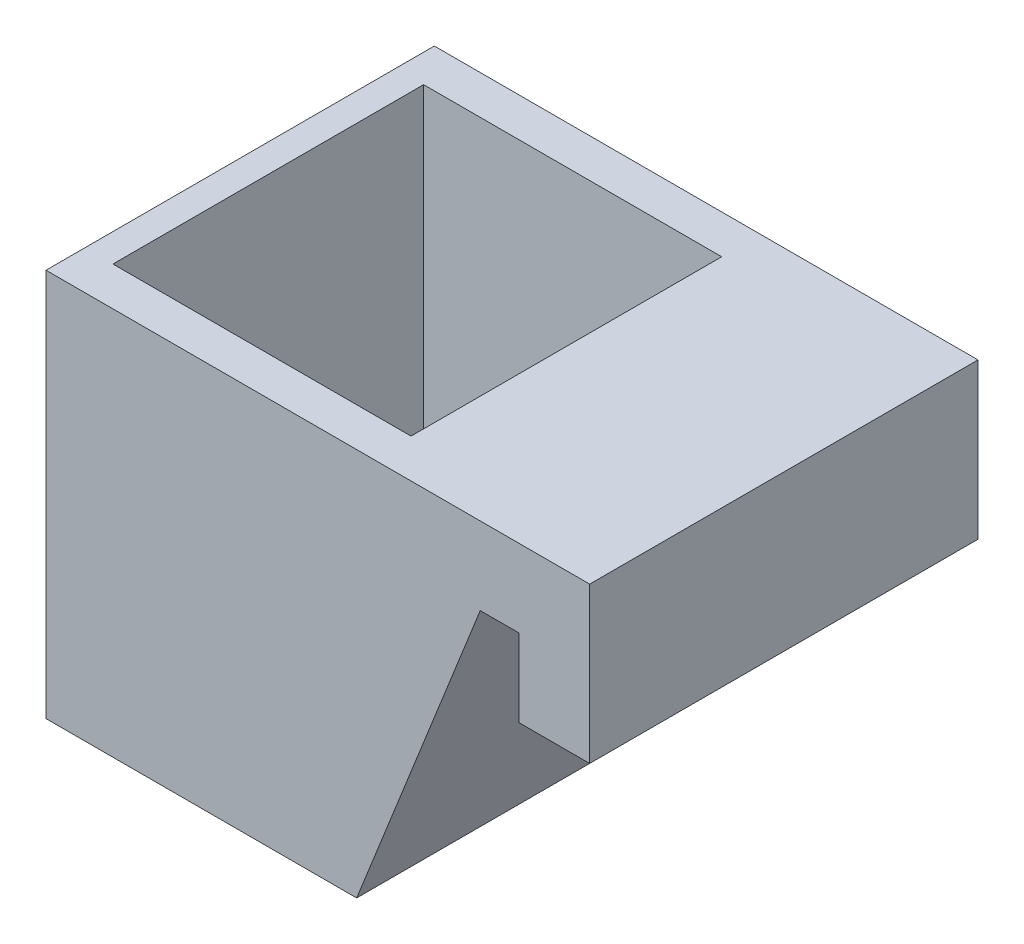
ISO-10303-21;
HEADER;
FILE_DESCRIPTION(('STEP AP214'),'2;1');
FILE_NAME('part.step','',(''),(''),'','','');
FILE_SCHEMA(('AUTOMOTIVE_DESIGN { 1 0 10303 214 1 1 1 1 }'));
ENDSEC;
DATA;
#1=APPLICATION_CONTEXT('core data for automotive mechanical design processes');
#2=APPLICATION_PROTOCOL_DEFINITION('international standard','automotive_design',2000,#1);
#3=PRODUCT_CONTEXT('',#1,'mechanical');
#4=PRODUCT('Part','Part','',(#3));
#5=PRODUCT_RELATED_PRODUCT_CATEGORY('part','',(#4));
#6=PRODUCT_DEFINITION_FORMATION('','',#4);
#7=PRODUCT_DEFINITION_CONTEXT('part definition',#1,'design');
#8=PRODUCT_DEFINITION('design','',#6,#7);
#9=PRODUCT_DEFINITION_SHAPE('','',#8);
#10=(LENGTH_UNIT() NAMED_UNIT(*) SI_UNIT(.MILLI.,.METRE.));
#11=(NAMED_UNIT(*) PLANE_ANGLE_UNIT() SI_UNIT($,.RADIAN.));
#12=(NAMED_UNIT(*) SI_UNIT($,.STERADIAN.) SOLID_ANGLE_UNIT());
#13=UNCERTAINTY_MEASURE_WITH_UNIT(LENGTH_MEASURE(1.E-05),#10,'distance_accuracy_value','');
#14=(GEOMETRIC_REPRESENTATION_CONTEXT(3) GLOBAL_UNCERTAINTY_ASSIGNED_CONTEXT((#13)) GLOBAL_UNIT_ASSIGNED_CONTEXT((#10,
#11,#12)) REPRESENTATION_CONTEXT('',''));
#15=CARTESIAN_POINT('',(0.,0.,0.));
#16=DIRECTION('',(0.,0.,1.));
#17=DIRECTION('',(1.,0.,0.));
#18=AXIS2_PLACEMENT_3D('',#15,#16,#17);
#19=CARTESIAN_POINT('',(14.0909090909091,31.8181818181818,50.));
#20=DIRECTION('',(0.,-1.,0.));
#21=DIRECTION('',(0.,0.,-1.));
#22=AXIS2_PLACEMENT_3D('',#19,#20,#21);
#23=PLANE('',#22);
#24=DIRECTION('',(-1.,0.,0.));
#25=VECTOR('',#24,1.);
#26=CARTESIAN_POINT('',(-13.9090909090909,31.8181818181818,5.));
#27=LINE('',#26,#25);
#28=CARTESIAN_POINT('',(-13.9090909090909,31.8181818181818,4.99999999999999));
#29=VERTEX_POINT('',#28);
#30=CARTESIAN_POINT('',(-52.2909865349845,31.8181818181818,5.00000000000001));
#31=VERTEX_POINT('',#30);
#32=EDGE_CURVE('E221',#29,#31,#27,.T.);
#33=ORIENTED_EDGE('',*,*,#32,.F.);
#34=DIRECTION('',(0.,0.,-1.));
#35=VECTOR('',#34,1.);
#36=CARTESIAN_POINT('',(-13.9090909090909,31.8181818181818,5.));
#37=LINE('',#36,#35);
#38=CARTESIAN_POINT('',(-13.9090909090909,31.8181818181818,45.));
#39=VERTEX_POINT('',#38);
#40=EDGE_CURVE('E195',#39,#29,#37,.T.);
#41=ORIENTED_EDGE('',*,*,#40,.F.);
#42=DIRECTION('',(1.,0.,0.));
#43=VECTOR('',#42,1.);
#44=CARTESIAN_POINT('',(-13.9090909090909,31.8181818181818,45.));
#45=LINE('',#44,#43);
#46=CARTESIAN_POINT('',(-52.2909865349845,31.8181818181818,45.));
#47=VERTEX_POINT('',#46);
#48=EDGE_CURVE('E206',#47,#39,#45,.T.);
#49=ORIENTED_EDGE('',*,*,#48,.F.);
#50=DIRECTION('',(0.,0.,1.));
#51=VECTOR('',#50,1.);
#52=CARTESIAN_POINT('',(-52.2909865349845,31.8181818181818,5.00000000000001));
#53=LINE('',#52,#51);
#54=EDGE_CURVE('E225',#31,#47,#53,.T.);
#55=ORIENTED_EDGE('',*,*,#54,.F.);
#56=EDGE_LOOP('',(#33,#41,#49,#55));
#57=FACE_BOUND('',#56,.T.);
#58=DIRECTION('',(-1.,0.,0.));
#59=VECTOR('',#58,1.);
#60=CARTESIAN_POINT('',(14.0909090909091,31.8181818181818,0.));
#61=LINE('',#60,#59);
#62=CARTESIAN_POINT('',(14.0909090909091,31.8181818181818,0.));
#63=VERTEX_POINT('',#62);
#64=CARTESIAN_POINT('',(-55.9090909090909,31.8181818181818,0.));
#65=VERTEX_POINT('',#64);
#66=EDGE_CURVE('E235',#63,#65,#61,.T.);
#67=ORIENTED_EDGE('',*,*,#66,.T.);
#68=DIRECTION('',(0.,0.,-1.));
#69=VECTOR('',#68,1.);
#70=CARTESIAN_POINT('',(-55.9090909090909,31.8181818181818,50.));
#71=LINE('',#70,#69);
#72=CARTESIAN_POINT('',(-55.9090909090909,31.8181818181818,50.));
#73=VERTEX_POINT('',#72);
#74=EDGE_CURVE('E11',#73,#65,#71,.T.);
#75=ORIENTED_EDGE('',*,*,#74,.F.);
#76=DIRECTION('',(-1.,0.,0.));
#77=VECTOR('',#76,1.);
#78=CARTESIAN_POINT('',(14.0909090909091,31.8181818181818,50.));
#79=LINE('',#78,#77);
#80=CARTESIAN_POINT('',(14.0909090909091,31.8181818181818,50.));
#81=VERTEX_POINT('',#80);
#82=EDGE_CURVE('E245',#81,#73,#79,.T.);
#83=ORIENTED_EDGE('',*,*,#82,.F.);
#84=DIRECTION('',(0.,0.,-1.));
#85=VECTOR('',#84,1.);
#86=CARTESIAN_POINT('',(14.0909090909091,31.8181818181818,50.));
#87=LINE('',#86,#85);
#88=EDGE_CURVE('E271',#81,#63,#87,.T.);
#89=ORIENTED_EDGE('',*,*,#88,.T.);
#90=EDGE_LOOP('',(#67,#75,#83,#89));
#91=FACE_BOUND('',#90,.T.);
#92=ADVANCED_FACE('F39',(#57,#91),#23,.F.);
#93=CARTESIAN_POINT('',(-55.9090909090909,31.8181818181818,50.));
#94=DIRECTION('',(1.,0.,0.));
#95=DIRECTION('',(0.,0.,-1.));
#96=AXIS2_PLACEMENT_3D('',#93,#94,#95);
#97=PLANE('',#96);
#98=DIRECTION('',(0.,-1.,0.));
#99=VECTOR('',#98,1.);
#100=CARTESIAN_POINT('',(-55.9090909090909,31.8181818181818,0.));
#101=LINE('',#100,#99);
#102=CARTESIAN_POINT('',(-55.9090909090909,-18.1818181818182,0.));
#103=VERTEX_POINT('',#102);
#104=EDGE_CURVE('E275',#65,#103,#101,.T.);
#105=ORIENTED_EDGE('',*,*,#104,.T.);
#106=DIRECTION('',(0.,0.,-1.));
#107=VECTOR('',#106,1.);
#108=CARTESIAN_POINT('',(-55.9090909090909,-18.1818181818182,50.));
#109=LINE('',#108,#107);
#110=CARTESIAN_POINT('',(-55.9090909090909,-18.1818181818182,50.));
#111=VERTEX_POINT('',#110);
#112=EDGE_CURVE('E47',#111,#103,#109,.T.);
#113=ORIENTED_EDGE('',*,*,#112,.F.);
#114=DIRECTION('',(0.,-1.,0.));
#115=VECTOR('',#114,1.);
#116=CARTESIAN_POINT('',(-55.9090909090909,31.8181818181818,50.));
#117=LINE('',#116,#115);
#118=EDGE_CURVE('E249',#73,#111,#117,.T.);
#119=ORIENTED_EDGE('',*,*,#118,.F.);
#120=ORIENTED_EDGE('',*,*,#74,.T.);
#121=EDGE_LOOP('',(#105,#113,#119,#120));
#122=FACE_BOUND('',#121,.T.);
#123=ADVANCED_FACE('F344',(#122),#97,.F.);
#124=CARTESIAN_POINT('',(-55.9090909090909,-18.1818181818182,50.));
#125=DIRECTION('',(0.,1.,0.));
#126=DIRECTION('',(0.,0.,1.));
#127=AXIS2_PLACEMENT_3D('',#124,#125,#126);
#128=PLANE('',#127);
#129=DIRECTION('',(1.,0.,0.));
#130=VECTOR('',#129,1.);
#131=CARTESIAN_POINT('',(-55.9090909090909,-18.1818181818182,0.));
#132=LINE('',#131,#130);
#133=CARTESIAN_POINT('',(-15.9090909090909,-18.1818181818182,0.));
#134=VERTEX_POINT('',#133);
#135=EDGE_CURVE('E278',#103,#134,#132,.T.);
#136=ORIENTED_EDGE('',*,*,#135,.T.);
#137=DIRECTION('',(0.,0.,-1.));
#138=VECTOR('',#137,1.);
#139=CARTESIAN_POINT('',(-15.9090909090909,-18.1818181818182,50.));
#140=LINE('',#139,#138);
#141=CARTESIAN_POINT('',(-15.9090909090909,-18.1818181818182,50.));
#142=VERTEX_POINT('',#141);
#143=EDGE_CURVE('E314',#142,#134,#140,.T.);
#144=ORIENTED_EDGE('',*,*,#143,.F.);
#145=DIRECTION('',(1.,0.,0.));
#146=VECTOR('',#145,1.);
#147=CARTESIAN_POINT('',(-55.9090909090909,-18.1818181818182,50.));
#148=LINE('',#147,#146);
#149=EDGE_CURVE('E253',#111,#142,#148,.T.);
#150=ORIENTED_EDGE('',*,*,#149,.F.);
#151=ORIENTED_EDGE('',*,*,#112,.T.);
#152=EDGE_LOOP('',(#136,#144,#150,#151));
#153=FACE_BOUND('',#152,.T.);
#154=ADVANCED_FACE('F323',(#153),#128,.F.);
#155=CARTESIAN_POINT('',(-15.9090909090909,-18.1818181818182,50.));
#156=DIRECTION('',(-0.929203121657371,0.369569423386455,0.));
#157=DIRECTION('',(-0.369569423386455,-0.929203121657371,0.));
#158=AXIS2_PLACEMENT_3D('',#155,#156,#157);
#159=PLANE('',#158);
#160=DIRECTION('',(0.369569423386455,0.929203121657371,0.));
#161=VECTOR('',#160,1.);
#162=CARTESIAN_POINT('',(-15.9090909090909,-18.1818181818182,0.));
#163=LINE('',#162,#161);
#164=CARTESIAN_POINT('',(0.,21.8181818181818,0.));
#165=VERTEX_POINT('',#164);
#166=EDGE_CURVE('E281',#134,#165,#163,.T.);
#167=ORIENTED_EDGE('',*,*,#166,.T.);
#168=DIRECTION('',(0.,0.,-1.));
#169=VECTOR('',#168,1.);
#170=CARTESIAN_POINT('',(0.,21.8181818181818,50.));
#171=LINE('',#170,#169);
#172=CARTESIAN_POINT('',(0.,21.8181818181818,50.));
#173=VERTEX_POINT('',#172);
#174=EDGE_CURVE('E310',#173,#165,#171,.T.);
#175=ORIENTED_EDGE('',*,*,#174,.F.);
#176=DIRECTION('',(0.369569423386455,0.929203121657371,0.));
#177=VECTOR('',#176,1.);
#178=CARTESIAN_POINT('',(-15.9090909090909,-18.1818181818182,50.));
#179=LINE('',#178,#177);
#180=EDGE_CURVE('E256',#142,#173,#179,.T.);
#181=ORIENTED_EDGE('',*,*,#180,.F.);
#182=ORIENTED_EDGE('',*,*,#143,.T.);
#183=EDGE_LOOP('',(#167,#175,#181,#182));
#184=FACE_BOUND('',#183,.T.);
#185=ADVANCED_FACE('F332',(#184),#159,.F.);
#186=CARTESIAN_POINT('',(0.,21.8181818181818,50.));
#187=DIRECTION('',(0.,1.,0.));
#188=DIRECTION('',(0.,0.,1.));
#189=AXIS2_PLACEMENT_3D('',#186,#187,#188);
#190=PLANE('',#189);
#191=DIRECTION('',(1.,0.,0.));
#192=VECTOR('',#191,1.);
#193=CARTESIAN_POINT('',(0.,21.8181818181818,0.));
#194=LINE('',#193,#192);
#195=CARTESIAN_POINT('',(5.,21.8181818181818,0.));
#196=VERTEX_POINT('',#195);
#197=EDGE_CURVE('E284',#165,#196,#194,.T.);
#198=ORIENTED_EDGE('',*,*,#197,.T.);
#199=DIRECTION('',(0.,0.,-1.));
#200=VECTOR('',#199,1.);
#201=CARTESIAN_POINT('',(5.,21.8181818181818,50.));
#202=LINE('',#201,#200);
#203=CARTESIAN_POINT('',(5.,21.8181818181818,50.));
#204=VERTEX_POINT('',#203);
#205=EDGE_CURVE('E306',#204,#196,#202,.T.);
#206=ORIENTED_EDGE('',*,*,#205,.F.);
#207=DIRECTION('',(1.,0.,0.));
#208=VECTOR('',#207,1.);
#209=CARTESIAN_POINT('',(0.,21.8181818181818,50.));
#210=LINE('',#209,#208);
#211=EDGE_CURVE('E259',#173,#204,#210,.T.);
#212=ORIENTED_EDGE('',*,*,#211,.F.);
#213=ORIENTED_EDGE('',*,*,#174,.T.);
#214=EDGE_LOOP('',(#198,#206,#212,#213));
#215=FACE_BOUND('',#214,.T.);
#216=ADVANCED_FACE('F336',(#215),#190,.F.);
#217=CARTESIAN_POINT('',(5.,21.8181818181818,50.));
#218=DIRECTION('',(1.,0.,0.));
#219=DIRECTION('',(0.,1.,0.));
#220=AXIS2_PLACEMENT_3D('',#217,#218,#219);
#221=PLANE('',#220);
#222=DIRECTION('',(0.,-1.,0.));
#223=VECTOR('',#222,1.);
#224=CARTESIAN_POINT('',(5.,21.8181818181818,0.));
#225=LINE('',#224,#223);
#226=CARTESIAN_POINT('',(5.,11.8181818181818,0.));
#227=VERTEX_POINT('',#226);
#228=EDGE_CURVE('E287',#196,#227,#225,.T.);
#229=ORIENTED_EDGE('',*,*,#228,.T.);
#230=DIRECTION('',(0.,0.,-1.));
#231=VECTOR('',#230,1.);
#232=CARTESIAN_POINT('',(5.,11.8181818181818,50.));
#233=LINE('',#232,#231);
#234=CARTESIAN_POINT('',(5.,11.8181818181818,50.));
#235=VERTEX_POINT('',#234);
#236=EDGE_CURVE('E302',#235,#227,#233,.T.);
#237=ORIENTED_EDGE('',*,*,#236,.F.);
#238=DIRECTION('',(0.,-1.,0.));
#239=VECTOR('',#238,1.);
#240=CARTESIAN_POINT('',(5.,21.8181818181818,50.));
#241=LINE('',#240,#239);
#242=EDGE_CURVE('E262',#204,#235,#241,.T.);
#243=ORIENTED_EDGE('',*,*,#242,.F.);
#244=ORIENTED_EDGE('',*,*,#205,.T.);
#245=EDGE_LOOP('',(#229,#237,#243,#244));
#246=FACE_BOUND('',#245,.T.);
#247=ADVANCED_FACE('F357',(#246),#221,.F.);
#248=CARTESIAN_POINT('',(5.,11.8181818181818,50.));
#249=DIRECTION('',(0.,1.,0.));
#250=DIRECTION('',(0.,0.,1.));
#251=AXIS2_PLACEMENT_3D('',#248,#249,#250);
#252=PLANE('',#251);
#253=DIRECTION('',(1.,0.,0.));
#254=VECTOR('',#253,1.);
#255=CARTESIAN_POINT('',(5.,11.8181818181818,0.));
#256=LINE('',#255,#254);
#257=CARTESIAN_POINT('',(14.0909090909091,11.8181818181818,0.));
#258=VERTEX_POINT('',#257);
#259=EDGE_CURVE('E290',#227,#258,#256,.T.);
#260=ORIENTED_EDGE('',*,*,#259,.T.);
#261=DIRECTION('',(0.,0.,-1.));
#262=VECTOR('',#261,1.);
#263=CARTESIAN_POINT('',(14.0909090909091,11.8181818181818,50.));
#264=LINE('',#263,#262);
#265=CARTESIAN_POINT('',(14.0909090909091,11.8181818181818,50.));
#266=VERTEX_POINT('',#265);
#267=EDGE_CURVE('E298',#266,#258,#264,.T.);
#268=ORIENTED_EDGE('',*,*,#267,.F.);
#269=DIRECTION('',(1.,0.,0.));
#270=VECTOR('',#269,1.);
#271=CARTESIAN_POINT('',(5.,11.8181818181818,50.));
#272=LINE('',#271,#270);
#273=EDGE_CURVE('E265',#235,#266,#272,.T.);
#274=ORIENTED_EDGE('',*,*,#273,.F.);
#275=ORIENTED_EDGE('',*,*,#236,.T.);
#276=EDGE_LOOP('',(#260,#268,#274,#275));
#277=FACE_BOUND('',#276,.T.);
#278=ADVANCED_FACE('F355',(#277),#252,.F.);
#279=CARTESIAN_POINT('',(14.0909090909091,11.8181818181818,50.));
#280=DIRECTION('',(-1.,0.,0.));
#281=DIRECTION('',(0.,0.,1.));
#282=AXIS2_PLACEMENT_3D('',#279,#280,#281);
#283=PLANE('',#282);
#284=DIRECTION('',(0.,1.,0.));
#285=VECTOR('',#284,1.);
#286=CARTESIAN_POINT('',(14.0909090909091,11.8181818181818,0.));
#287=LINE('',#286,#285);
#288=EDGE_CURVE('E250',#258,#63,#287,.T.);
#289=ORIENTED_EDGE('',*,*,#288,.T.);
#290=ORIENTED_EDGE('',*,*,#88,.F.);
#291=DIRECTION('',(0.,1.,0.));
#292=VECTOR('',#291,1.);
#293=CARTESIAN_POINT('',(14.0909090909091,11.8181818181818,50.));
#294=LINE('',#293,#292);
#295=EDGE_CURVE('E268',#266,#81,#294,.T.);
#296=ORIENTED_EDGE('',*,*,#295,.F.);
#297=ORIENTED_EDGE('',*,*,#267,.T.);
#298=EDGE_LOOP('',(#289,#290,#296,#297));
#299=FACE_BOUND('',#298,.T.);
#300=ADVANCED_FACE('F350',(#299),#283,.F.);
#301=CARTESIAN_POINT('',(0.,0.,50.));
#302=DIRECTION('',(0.,0.,1.));
#303=DIRECTION('',(1.,0.,0.));
#304=AXIS2_PLACEMENT_3D('',#301,#302,#303);
#305=PLANE('',#304);
#306=ORIENTED_EDGE('',*,*,#82,.T.);
#307=ORIENTED_EDGE('',*,*,#118,.T.);
#308=ORIENTED_EDGE('',*,*,#149,.T.);
#309=ORIENTED_EDGE('',*,*,#180,.T.);
#310=ORIENTED_EDGE('',*,*,#211,.T.);
#311=ORIENTED_EDGE('',*,*,#242,.T.);
#312=ORIENTED_EDGE('',*,*,#273,.T.);
#313=ORIENTED_EDGE('',*,*,#295,.T.);
#314=EDGE_LOOP('',(#306,#307,#308,#309,#310,#311,#312,#313));
#315=FACE_BOUND('',#314,.T.);
#316=ADVANCED_FACE('F340',(#315),#305,.T.);
#317=CARTESIAN_POINT('',(0.,0.,0.));
#318=DIRECTION('',(0.,0.,1.));
#319=DIRECTION('',(1.,0.,0.));
#320=AXIS2_PLACEMENT_3D('',#317,#318,#319);
#321=PLANE('',#320);
#322=DIRECTION('',(-1.,0.,0.));
#323=VECTOR('',#322,1.);
#324=CARTESIAN_POINT('',(-38.3568996056258,-3.54346504627756,0.));
#325=LINE('',#324,#323);
#326=CARTESIAN_POINT('',(-31.5660032608758,-3.54346504627756,0.));
#327=VERTEX_POINT('',#326);
#328=CARTESIAN_POINT('',(-38.3568996056258,-3.54346504627756,0.));
#329=VERTEX_POINT('',#328);
#330=EDGE_CURVE('E161',#327,#329,#325,.T.);
#331=ORIENTED_EDGE('',*,*,#330,.T.);
#332=DIRECTION('',(0.,-1.,0.));
#333=VECTOR('',#332,1.);
#334=CARTESIAN_POINT('',(-38.3568996056258,-3.54346504627756,0.));
#335=LINE('',#334,#333);
#336=CARTESIAN_POINT('',(-38.3568996056258,-7.34148029988546,0.));
#337=VERTEX_POINT('',#336);
#338=EDGE_CURVE('E154',#329,#337,#335,.T.);
#339=ORIENTED_EDGE('',*,*,#338,.T.);
#340=DIRECTION('',(1.,0.,0.));
#341=VECTOR('',#340,1.);
#342=CARTESIAN_POINT('',(-38.3568996056258,-7.34148029988546,0.));
#343=LINE('',#342,#341);
#344=CARTESIAN_POINT('',(-31.5660032608758,-7.34148029988546,0.));
#345=VERTEX_POINT('',#344);
#346=EDGE_CURVE('E164',#337,#345,#343,.T.);
#347=ORIENTED_EDGE('',*,*,#346,.T.);
#348=DIRECTION('',(0.,1.,0.));
#349=VECTOR('',#348,1.);
#350=CARTESIAN_POINT('',(-31.5660032608758,-3.54346504627756,0.));
#351=LINE('',#350,#349);
#352=EDGE_CURVE('E54',#345,#327,#351,.T.);
#353=ORIENTED_EDGE('',*,*,#352,.T.);
#354=EDGE_LOOP('',(#331,#339,#347,#353));
#355=FACE_BOUND('',#354,.T.);
#356=ORIENTED_EDGE('',*,*,#66,.F.);
#357=ORIENTED_EDGE('',*,*,#288,.F.);
#358=ORIENTED_EDGE('',*,*,#259,.F.);
#359=ORIENTED_EDGE('',*,*,#228,.F.);
#360=ORIENTED_EDGE('',*,*,#197,.F.);
#361=ORIENTED_EDGE('',*,*,#166,.F.);
#362=ORIENTED_EDGE('',*,*,#135,.F.);
#363=ORIENTED_EDGE('',*,*,#104,.F.);
#364=EDGE_LOOP('',(#356,#357,#358,#359,#360,#361,#362,#363));
#365=FACE_BOUND('',#364,.T.);
#366=ADVANCED_FACE('F169',(#355,#365),#321,.F.);
#367=CARTESIAN_POINT('',(-13.9090909090909,-9.18181818181818,5.));
#368=DIRECTION('',(1.,0.,0.));
#369=DIRECTION('',(0.,0.,-1.));
#370=AXIS2_PLACEMENT_3D('',#367,#368,#369);
#371=PLANE('',#370);
#372=ORIENTED_EDGE('',*,*,#40,.T.);
#373=DIRECTION('',(0.,1.,0.));
#374=VECTOR('',#373,1.);
#375=CARTESIAN_POINT('',(-13.9090909090909,-9.18181818181818,5.));
#376=LINE('',#375,#374);
#377=CARTESIAN_POINT('',(-13.9090909090909,-9.18181818181818,5.));
#378=VERTEX_POINT('',#377);
#379=EDGE_CURVE('E218',#378,#29,#376,.T.);
#380=ORIENTED_EDGE('',*,*,#379,.F.);
#381=DIRECTION('',(0.,0.,-1.));
#382=VECTOR('',#381,1.);
#383=CARTESIAN_POINT('',(-13.9090909090909,-9.18181818181818,5.));
#384=LINE('',#383,#382);
#385=CARTESIAN_POINT('',(-13.9090909090909,-9.18181818181818,45.));
#386=VERTEX_POINT('',#385);
#387=EDGE_CURVE('E201',#386,#378,#384,.T.);
#388=ORIENTED_EDGE('',*,*,#387,.F.);
#389=DIRECTION('',(0.,1.,0.));
#390=VECTOR('',#389,1.);
#391=CARTESIAN_POINT('',(-13.9090909090909,-9.18181818181818,45.));
#392=LINE('',#391,#390);
#393=EDGE_CURVE('E232',#386,#39,#392,.T.);
#394=ORIENTED_EDGE('',*,*,#393,.T.);
#395=EDGE_LOOP('',(#372,#380,#388,#394));
#396=FACE_BOUND('',#395,.T.);
#397=ADVANCED_FACE('F381',(#396),#371,.F.);
#398=CARTESIAN_POINT('',(-13.9090909090909,-9.18181818181818,45.));
#399=DIRECTION('',(0.,0.,1.));
#400=DIRECTION('',(1.,0.,0.));
#401=AXIS2_PLACEMENT_3D('',#398,#399,#400);
#402=PLANE('',#401);
#403=ORIENTED_EDGE('',*,*,#48,.T.);
#404=ORIENTED_EDGE('',*,*,#393,.F.);
#405=DIRECTION('',(1.,0.,0.));
#406=VECTOR('',#405,1.);
#407=CARTESIAN_POINT('',(-13.9090909090909,-9.18181818181818,45.));
#408=LINE('',#407,#406);
#409=CARTESIAN_POINT('',(-52.2909865349845,-9.18181818181818,45.));
#410=VERTEX_POINT('',#409);
#411=EDGE_CURVE('E214',#410,#386,#408,.T.);
#412=ORIENTED_EDGE('',*,*,#411,.F.);
#413=DIRECTION('',(0.,1.,0.));
#414=VECTOR('',#413,1.);
#415=CARTESIAN_POINT('',(-52.2909865349845,-9.18181818181818,45.));
#416=LINE('',#415,#414);
#417=EDGE_CURVE('E236',#410,#47,#416,.T.);
#418=ORIENTED_EDGE('',*,*,#417,.T.);
#419=EDGE_LOOP('',(#403,#404,#412,#418));
#420=FACE_BOUND('',#419,.T.);
#421=ADVANCED_FACE('F384',(#420),#402,.F.);
#422=CARTESIAN_POINT('',(-52.2909865349845,-9.18181818181818,5.00000000000001));
#423=DIRECTION('',(-1.,0.,0.));
#424=DIRECTION('',(0.,0.,1.));
#425=AXIS2_PLACEMENT_3D('',#422,#423,#424);
#426=PLANE('',#425);
#427=ORIENTED_EDGE('',*,*,#54,.T.);
#428=ORIENTED_EDGE('',*,*,#417,.F.);
#429=DIRECTION('',(0.,0.,1.));
#430=VECTOR('',#429,1.);
#431=CARTESIAN_POINT('',(-52.2909865349845,-9.18181818181818,5.00000000000001));
#432=LINE('',#431,#430);
#433=CARTESIAN_POINT('',(-52.2909865349845,-9.18181818181818,5.00000000000001));
#434=VERTEX_POINT('',#433);
#435=EDGE_CURVE('E210',#434,#410,#432,.T.);
#436=ORIENTED_EDGE('',*,*,#435,.F.);
#437=DIRECTION('',(0.,1.,0.));
#438=VECTOR('',#437,1.);
#439=CARTESIAN_POINT('',(-52.2909865349845,-9.18181818181818,5.00000000000001));
#440=LINE('',#439,#438);
#441=EDGE_CURVE('E239',#434,#31,#440,.T.);
#442=ORIENTED_EDGE('',*,*,#441,.T.);
#443=EDGE_LOOP('',(#427,#428,#436,#442));
#444=FACE_BOUND('',#443,.T.);
#445=ADVANCED_FACE('F386',(#444),#426,.F.);
#446=CARTESIAN_POINT('',(-13.9090909090909,-9.18181818181818,5.));
#447=DIRECTION('',(0.,0.,-1.));
#448=DIRECTION('',(-1.,0.,0.));
#449=AXIS2_PLACEMENT_3D('',#446,#447,#448);
#450=PLANE('',#449);
#451=DIRECTION('',(1.,0.,0.));
#452=VECTOR('',#451,1.);
#453=CARTESIAN_POINT('',(-38.3568996056258,-7.34148029988546,5.));
#454=LINE('',#453,#452);
#455=CARTESIAN_POINT('',(-38.3568996056258,-7.34148029988546,5.));
#456=VERTEX_POINT('',#455);
#457=CARTESIAN_POINT('',(-31.5660032608758,-7.34148029988546,5.));
#458=VERTEX_POINT('',#457);
#459=EDGE_CURVE('E186',#456,#458,#454,.T.);
#460=ORIENTED_EDGE('',*,*,#459,.F.);
#461=DIRECTION('',(0.,-1.,0.));
#462=VECTOR('',#461,1.);
#463=CARTESIAN_POINT('',(-38.3568996056258,-3.54346504627756,5.));
#464=LINE('',#463,#462);
#465=CARTESIAN_POINT('',(-38.3568996056258,-3.54346504627756,5.));
#466=VERTEX_POINT('',#465);
#467=EDGE_CURVE('E62',#466,#456,#464,.T.);
#468=ORIENTED_EDGE('',*,*,#467,.F.);
#469=DIRECTION('',(-1.,0.,0.));
#470=VECTOR('',#469,1.);
#471=CARTESIAN_POINT('',(-38.3568996056258,-3.54346504627756,5.));
#472=LINE('',#471,#470);
#473=CARTESIAN_POINT('',(-31.5660032608758,-3.54346504627756,5.));
#474=VERTEX_POINT('',#473);
#475=EDGE_CURVE('E173',#474,#466,#472,.T.);
#476=ORIENTED_EDGE('',*,*,#475,.F.);
#477=DIRECTION('',(0.,1.,0.));
#478=VECTOR('',#477,1.);
#479=CARTESIAN_POINT('',(-31.5660032608758,-3.54346504627756,5.));
#480=LINE('',#479,#478);
#481=EDGE_CURVE('E177',#458,#474,#480,.T.);
#482=ORIENTED_EDGE('',*,*,#481,.F.);
#483=EDGE_LOOP('',(#460,#468,#476,#482));
#484=FACE_BOUND('',#483,.T.);
#485=ORIENTED_EDGE('',*,*,#32,.T.);
#486=ORIENTED_EDGE('',*,*,#441,.F.);
#487=DIRECTION('',(-1.,0.,0.));
#488=VECTOR('',#487,1.);
#489=CARTESIAN_POINT('',(-13.9090909090909,-9.18181818181818,5.));
#490=LINE('',#489,#488);
#491=EDGE_CURVE('E205',#378,#434,#490,.T.);
#492=ORIENTED_EDGE('',*,*,#491,.F.);
#493=ORIENTED_EDGE('',*,*,#379,.T.);
#494=EDGE_LOOP('',(#485,#486,#492,#493));
#495=FACE_BOUND('',#494,.T.);
#496=ADVANCED_FACE('F376',(#484,#495),#450,.F.);
#497=CARTESIAN_POINT('',(0.,-9.18181818181818,0.));
#498=DIRECTION('',(0.,-1.,0.));
#499=DIRECTION('',(0.,0.,-1.));
#500=AXIS2_PLACEMENT_3D('',#497,#498,#499);
#501=PLANE('',#500);
#502=ORIENTED_EDGE('',*,*,#387,.T.);
#503=ORIENTED_EDGE('',*,*,#491,.T.);
#504=ORIENTED_EDGE('',*,*,#435,.T.);
#505=ORIENTED_EDGE('',*,*,#411,.T.);
#506=EDGE_LOOP('',(#502,#503,#504,#505));
#507=FACE_BOUND('',#506,.T.);
#508=ADVANCED_FACE('F388',(#507),#501,.F.);
#509=CARTESIAN_POINT('',(-38.3568996056258,-3.54346504627756,0.));
#510=DIRECTION('',(-1.,0.,0.));
#511=DIRECTION('',(0.,0.,1.));
#512=AXIS2_PLACEMENT_3D('',#509,#510,#511);
#513=PLANE('',#512);
#514=ORIENTED_EDGE('',*,*,#467,.T.);
#515=DIRECTION('',(0.,0.,1.));
#516=VECTOR('',#515,1.);
#517=CARTESIAN_POINT('',(-38.3568996056258,-7.34148029988546,0.));
#518=LINE('',#517,#516);
#519=EDGE_CURVE('E150',#337,#456,#518,.T.);
#520=ORIENTED_EDGE('',*,*,#519,.F.);
#521=ORIENTED_EDGE('',*,*,#338,.F.);
#522=DIRECTION('',(0.,0.,1.));
#523=VECTOR('',#522,1.);
#524=CARTESIAN_POINT('',(-38.3568996056258,-3.54346504627756,0.));
#525=LINE('',#524,#523);
#526=EDGE_CURVE('E192',#329,#466,#525,.T.);
#527=ORIENTED_EDGE('',*,*,#526,.T.);
#528=EDGE_LOOP('',(#514,#520,#521,#527));
#529=FACE_BOUND('',#528,.T.);
#530=ADVANCED_FACE('F152',(#529),#513,.F.);
#531=CARTESIAN_POINT('',(-38.3568996056258,-3.54346504627756,0.));
#532=DIRECTION('',(0.,1.,0.));
#533=DIRECTION('',(0.,0.,1.));
#534=AXIS2_PLACEMENT_3D('',#531,#532,#533);
#535=PLANE('',#534);
#536=ORIENTED_EDGE('',*,*,#475,.T.);
#537=ORIENTED_EDGE('',*,*,#526,.F.);
#538=ORIENTED_EDGE('',*,*,#330,.F.);
#539=DIRECTION('',(0.,0.,1.));
#540=VECTOR('',#539,1.);
#541=CARTESIAN_POINT('',(-31.5660032608758,-3.54346504627756,0.));
#542=LINE('',#541,#540);
#543=EDGE_CURVE('E196',#327,#474,#542,.T.);
#544=ORIENTED_EDGE('',*,*,#543,.T.);
#545=EDGE_LOOP('',(#536,#537,#538,#544));
#546=FACE_BOUND('',#545,.T.);
#547=ADVANCED_FACE('F395',(#546),#535,.F.);
#548=CARTESIAN_POINT('',(-31.5660032608758,-3.54346504627756,0.));
#549=DIRECTION('',(1.,0.,0.));
#550=DIRECTION('',(0.,0.,-1.));
#551=AXIS2_PLACEMENT_3D('',#548,#549,#550);
#552=PLANE('',#551);
#553=ORIENTED_EDGE('',*,*,#481,.T.);
#554=ORIENTED_EDGE('',*,*,#543,.F.);
#555=ORIENTED_EDGE('',*,*,#352,.F.);
#556=DIRECTION('',(0.,0.,1.));
#557=VECTOR('',#556,1.);
#558=CARTESIAN_POINT('',(-31.5660032608758,-7.34148029988546,0.));
#559=LINE('',#558,#557);
#560=EDGE_CURVE('E160',#345,#458,#559,.T.);
#561=ORIENTED_EDGE('',*,*,#560,.T.);
#562=EDGE_LOOP('',(#553,#554,#555,#561));
#563=FACE_BOUND('',#562,.T.);
#564=ADVANCED_FACE('F456',(#563),#552,.F.);
#565=CARTESIAN_POINT('',(-38.3568996056258,-7.34148029988546,0.));
#566=DIRECTION('',(0.,-1.,0.));
#567=DIRECTION('',(0.,0.,-1.));
#568=AXIS2_PLACEMENT_3D('',#565,#566,#567);
#569=PLANE('',#568);
#570=ORIENTED_EDGE('',*,*,#459,.T.);
#571=ORIENTED_EDGE('',*,*,#560,.F.);
#572=ORIENTED_EDGE('',*,*,#346,.F.);
#573=ORIENTED_EDGE('',*,*,#519,.T.);
#574=EDGE_LOOP('',(#570,#571,#572,#573));
#575=FACE_BOUND('',#574,.T.);
#576=ADVANCED_FACE('F165',(#575),#569,.F.);
#577=CLOSED_SHELL('',(#92,#123,#154,#185,#216,#247,#278,#300,#316,#366,#397,#421,#445,#496,#508,
#530,#547,#564,#576));
#578=MANIFOLD_SOLID_BREP('B2',#577);
#579=ADVANCED_BREP_SHAPE_REPRESENTATION('',(#18,#578),#14);
#580=SHAPE_DEFINITION_REPRESENTATION(#9,#579);
ENDSEC;
END-ISO-10303-21;
